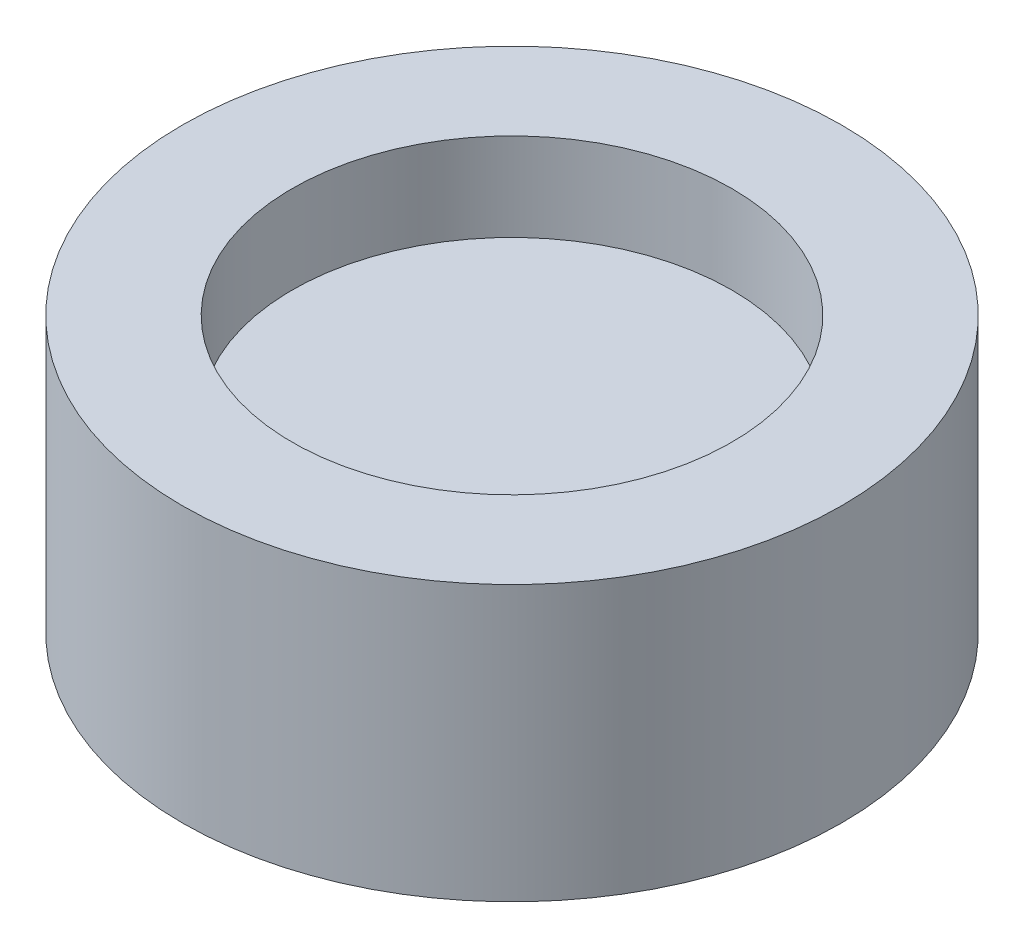
ISO-10303-21;
HEADER;
FILE_DESCRIPTION(('STEP AP214'),'2;1');
FILE_NAME('part.step','',(''),(''),'','','');
FILE_SCHEMA(('AUTOMOTIVE_DESIGN { 1 0 10303 214 1 1 1 1 }'));
ENDSEC;
DATA;
#1=APPLICATION_CONTEXT('core data for automotive mechanical design processes');
#2=APPLICATION_PROTOCOL_DEFINITION('international standard','automotive_design',2000,#1);
#3=PRODUCT_CONTEXT('',#1,'mechanical');
#4=PRODUCT('Part','Part','',(#3));
#5=PRODUCT_RELATED_PRODUCT_CATEGORY('part','',(#4));
#6=PRODUCT_DEFINITION_FORMATION('','',#4);
#7=PRODUCT_DEFINITION_CONTEXT('part definition',#1,'design');
#8=PRODUCT_DEFINITION('design','',#6,#7);
#9=PRODUCT_DEFINITION_SHAPE('','',#8);
#10=(LENGTH_UNIT() NAMED_UNIT(*) SI_UNIT(.MILLI.,.METRE.));
#11=(NAMED_UNIT(*) PLANE_ANGLE_UNIT() SI_UNIT($,.RADIAN.));
#12=(NAMED_UNIT(*) SI_UNIT($,.STERADIAN.) SOLID_ANGLE_UNIT());
#13=UNCERTAINTY_MEASURE_WITH_UNIT(LENGTH_MEASURE(1.E-05),#10,'distance_accuracy_value','');
#14=(GEOMETRIC_REPRESENTATION_CONTEXT(3) GLOBAL_UNCERTAINTY_ASSIGNED_CONTEXT((#13)) GLOBAL_UNIT_ASSIGNED_CONTEXT((#10,
#11,#12)) REPRESENTATION_CONTEXT('',''));
#15=CARTESIAN_POINT('',(0.,0.,0.));
#16=DIRECTION('',(0.,0.,1.));
#17=DIRECTION('',(1.,0.,0.));
#18=AXIS2_PLACEMENT_3D('',#15,#16,#17);
#19=CARTESIAN_POINT('',(200.,170.,0.));
#20=DIRECTION('',(0.,1.,0.));
#21=DIRECTION('',(0.,0.,1.));
#22=AXIS2_PLACEMENT_3D('',#19,#20,#21);
#23=PLANE('',#22);
#24=CARTESIAN_POINT('',(0.,170.,0.));
#25=DIRECTION('',(0.,-1.,0.));
#26=DIRECTION('',(0.,0.,-1.));
#27=AXIS2_PLACEMENT_3D('',#24,#25,#26);
#28=CIRCLE('',#27,200.);
#29=CARTESIAN_POINT('',(0.,170.,-200.));
#30=VERTEX_POINT('',#29);
#31=EDGE_CURVE('E10',#30,#30,#28,.T.);
#32=ORIENTED_EDGE('',*,*,#31,.F.);
#33=EDGE_LOOP('',(#32));
#34=FACE_BOUND('',#33,.T.);
#35=ADVANCED_FACE('F33',(#34),#23,.T.);
#36=CARTESIAN_POINT('',(0.,0.,0.));
#37=DIRECTION('',(0.,-1.,0.));
#38=DIRECTION('',(0.,0.,-1.));
#39=AXIS2_PLACEMENT_3D('',#36,#37,#38);
#40=CYLINDRICAL_SURFACE('',#39,200.);
#41=ORIENTED_EDGE('',*,*,#31,.T.);
#42=EDGE_LOOP('',(#41));
#43=FACE_BOUND('',#42,.T.);
#44=CARTESIAN_POINT('',(0.,250.,0.));
#45=DIRECTION('',(0.,-1.,0.));
#46=DIRECTION('',(0.,0.,-1.));
#47=AXIS2_PLACEMENT_3D('',#44,#45,#46);
#48=CIRCLE('',#47,200.);
#49=CARTESIAN_POINT('',(0.,250.,-200.));
#50=VERTEX_POINT('',#49);
#51=EDGE_CURVE('E39',#50,#50,#48,.T.);
#52=ORIENTED_EDGE('',*,*,#51,.F.);
#53=EDGE_LOOP('',(#52));
#54=FACE_BOUND('',#53,.T.);
#55=ADVANCED_FACE('F107',(#43,#54),#40,.F.);
#56=CARTESIAN_POINT('',(200.,250.,0.));
#57=DIRECTION('',(0.,1.,0.));
#58=DIRECTION('',(0.,0.,1.));
#59=AXIS2_PLACEMENT_3D('',#56,#57,#58);
#60=PLANE('',#59);
#61=ORIENTED_EDGE('',*,*,#51,.T.);
#62=EDGE_LOOP('',(#61));
#63=FACE_BOUND('',#62,.T.);
#64=CARTESIAN_POINT('',(0.,250.,0.));
#65=DIRECTION('',(0.,-1.,0.));
#66=DIRECTION('',(0.,0.,-1.));
#67=AXIS2_PLACEMENT_3D('',#64,#65,#66);
#68=CIRCLE('',#67,300.);
#69=CARTESIAN_POINT('',(0.,250.,-300.));
#70=VERTEX_POINT('',#69);
#71=EDGE_CURVE('E43',#70,#70,#68,.T.);
#72=ORIENTED_EDGE('',*,*,#71,.F.);
#73=EDGE_LOOP('',(#72));
#74=FACE_BOUND('',#73,.T.);
#75=ADVANCED_FACE('F101',(#63,#74),#60,.T.);
#76=CARTESIAN_POINT('',(0.,0.,0.));
#77=DIRECTION('',(0.,-1.,0.));
#78=DIRECTION('',(0.,0.,-1.));
#79=AXIS2_PLACEMENT_3D('',#76,#77,#78);
#80=CYLINDRICAL_SURFACE('',#79,300.);
#81=ORIENTED_EDGE('',*,*,#71,.T.);
#82=EDGE_LOOP('',(#81));
#83=FACE_BOUND('',#82,.T.);
#84=CARTESIAN_POINT('',(0.,0.,0.));
#85=DIRECTION('',(0.,-1.,0.));
#86=DIRECTION('',(0.,0.,-1.));
#87=AXIS2_PLACEMENT_3D('',#84,#85,#86);
#88=CIRCLE('',#87,300.);
#89=CARTESIAN_POINT('',(0.,0.,-300.));
#90=VERTEX_POINT('',#89);
#91=EDGE_CURVE('E47',#90,#90,#88,.T.);
#92=ORIENTED_EDGE('',*,*,#91,.F.);
#93=EDGE_LOOP('',(#92));
#94=FACE_BOUND('',#93,.T.);
#95=ADVANCED_FACE('F90',(#83,#94),#80,.T.);
#96=CARTESIAN_POINT('',(300.,0.,0.));
#97=DIRECTION('',(0.,-1.,0.));
#98=DIRECTION('',(0.,0.,-1.));
#99=AXIS2_PLACEMENT_3D('',#96,#97,#98);
#100=PLANE('',#99);
#101=CARTESIAN_POINT('',(-71.,0.,-55.));
#102=DIRECTION('',(0.,-1.,0.));
#103=DIRECTION('',(0.,0.,-1.));
#104=AXIS2_PLACEMENT_3D('',#101,#102,#103);
#105=CIRCLE('',#104,8.);
#106=CARTESIAN_POINT('',(-71.,0.,-63.));
#107=VERTEX_POINT('',#106);
#108=EDGE_CURVE('E71',#107,#107,#105,.T.);
#109=ORIENTED_EDGE('',*,*,#108,.F.);
#110=EDGE_LOOP('',(#109));
#111=FACE_BOUND('',#110,.T.);
#112=CARTESIAN_POINT('',(71.,0.,-55.));
#113=DIRECTION('',(0.,-1.,0.));
#114=DIRECTION('',(0.,0.,-1.));
#115=AXIS2_PLACEMENT_3D('',#112,#113,#114);
#116=CIRCLE('',#115,8.00000000000003);
#117=CARTESIAN_POINT('',(71.,0.,-63.));
#118=VERTEX_POINT('',#117);
#119=EDGE_CURVE('E65',#118,#118,#116,.T.);
#120=ORIENTED_EDGE('',*,*,#119,.F.);
#121=EDGE_LOOP('',(#120));
#122=FACE_BOUND('',#121,.T.);
#123=CARTESIAN_POINT('',(71.,0.,55.));
#124=DIRECTION('',(0.,-1.,0.));
#125=DIRECTION('',(0.,0.,-1.));
#126=AXIS2_PLACEMENT_3D('',#123,#124,#125);
#127=CIRCLE('',#126,8.00000000000003);
#128=CARTESIAN_POINT('',(71.,0.,47.));
#129=VERTEX_POINT('',#128);
#130=EDGE_CURVE('E59',#129,#129,#127,.T.);
#131=ORIENTED_EDGE('',*,*,#130,.F.);
#132=EDGE_LOOP('',(#131));
#133=FACE_BOUND('',#132,.T.);
#134=CARTESIAN_POINT('',(-71.,0.,55.));
#135=DIRECTION('',(0.,-1.,0.));
#136=DIRECTION('',(0.,0.,-1.));
#137=AXIS2_PLACEMENT_3D('',#134,#135,#136);
#138=CIRCLE('',#137,8.);
#139=CARTESIAN_POINT('',(-71.,0.,47.));
#140=VERTEX_POINT('',#139);
#141=EDGE_CURVE('E53',#140,#140,#138,.T.);
#142=ORIENTED_EDGE('',*,*,#141,.F.);
#143=EDGE_LOOP('',(#142));
#144=FACE_BOUND('',#143,.T.);
#145=ORIENTED_EDGE('',*,*,#91,.T.);
#146=EDGE_LOOP('',(#145));
#147=FACE_BOUND('',#146,.T.);
#148=ADVANCED_FACE('F86',(#111,#122,#133,#144,#147),#100,.T.);
#149=CARTESIAN_POINT('',(-71.,10.,55.));
#150=DIRECTION('',(0.,-1.,0.));
#151=DIRECTION('',(0.,0.,-1.));
#152=AXIS2_PLACEMENT_3D('',#149,#150,#151);
#153=CYLINDRICAL_SURFACE('',#152,8.);
#154=CARTESIAN_POINT('',(-71.,10.,55.));
#155=DIRECTION('',(0.,-1.,0.));
#156=DIRECTION('',(0.,0.,-1.));
#157=AXIS2_PLACEMENT_3D('',#154,#155,#156);
#158=CIRCLE('',#157,8.);
#159=CARTESIAN_POINT('',(-71.,10.,47.));
#160=VERTEX_POINT('',#159);
#161=EDGE_CURVE('E52',#160,#160,#158,.T.);
#162=ORIENTED_EDGE('',*,*,#161,.F.);
#163=EDGE_LOOP('',(#162));
#164=FACE_BOUND('',#163,.T.);
#165=ORIENTED_EDGE('',*,*,#141,.T.);
#166=EDGE_LOOP('',(#165));
#167=FACE_BOUND('',#166,.T.);
#168=ADVANCED_FACE('F89',(#164,#167),#153,.F.);
#169=CARTESIAN_POINT('',(-71.,10.,55.));
#170=DIRECTION('',(0.,-1.,0.));
#171=DIRECTION('',(0.,0.,-1.));
#172=AXIS2_PLACEMENT_3D('',#169,#170,#171);
#173=PLANE('',#172);
#174=ORIENTED_EDGE('',*,*,#161,.T.);
#175=EDGE_LOOP('',(#174));
#176=FACE_BOUND('',#175,.T.);
#177=ADVANCED_FACE('F140',(#176),#173,.T.);
#178=CARTESIAN_POINT('',(71.,10.,55.));
#179=DIRECTION('',(0.,-1.,0.));
#180=DIRECTION('',(0.,0.,-1.));
#181=AXIS2_PLACEMENT_3D('',#178,#179,#180);
#182=CYLINDRICAL_SURFACE('',#181,8.00000000000003);
#183=CARTESIAN_POINT('',(71.,10.,55.));
#184=DIRECTION('',(0.,-1.,0.));
#185=DIRECTION('',(0.,0.,-1.));
#186=AXIS2_PLACEMENT_3D('',#183,#184,#185);
#187=CIRCLE('',#186,8.00000000000003);
#188=CARTESIAN_POINT('',(71.,10.,47.));
#189=VERTEX_POINT('',#188);
#190=EDGE_CURVE('E56',#189,#189,#187,.T.);
#191=ORIENTED_EDGE('',*,*,#190,.F.);
#192=EDGE_LOOP('',(#191));
#193=FACE_BOUND('',#192,.T.);
#194=ORIENTED_EDGE('',*,*,#130,.T.);
#195=EDGE_LOOP('',(#194));
#196=FACE_BOUND('',#195,.T.);
#197=ADVANCED_FACE('F150',(#193,#196),#182,.F.);
#198=CARTESIAN_POINT('',(71.,10.,55.));
#199=DIRECTION('',(0.,-1.,0.));
#200=DIRECTION('',(0.,0.,-1.));
#201=AXIS2_PLACEMENT_3D('',#198,#199,#200);
#202=PLANE('',#201);
#203=ORIENTED_EDGE('',*,*,#190,.T.);
#204=EDGE_LOOP('',(#203));
#205=FACE_BOUND('',#204,.T.);
#206=ADVANCED_FACE('F160',(#205),#202,.T.);
#207=CARTESIAN_POINT('',(71.,10.,-55.));
#208=DIRECTION('',(0.,-1.,0.));
#209=DIRECTION('',(0.,0.,-1.));
#210=AXIS2_PLACEMENT_3D('',#207,#208,#209);
#211=CYLINDRICAL_SURFACE('',#210,8.00000000000003);
#212=CARTESIAN_POINT('',(71.,10.,-55.));
#213=DIRECTION('',(0.,-1.,0.));
#214=DIRECTION('',(0.,0.,-1.));
#215=AXIS2_PLACEMENT_3D('',#212,#213,#214);
#216=CIRCLE('',#215,8.00000000000003);
#217=CARTESIAN_POINT('',(71.,10.,-63.));
#218=VERTEX_POINT('',#217);
#219=EDGE_CURVE('E62',#218,#218,#216,.T.);
#220=ORIENTED_EDGE('',*,*,#219,.F.);
#221=EDGE_LOOP('',(#220));
#222=FACE_BOUND('',#221,.T.);
#223=ORIENTED_EDGE('',*,*,#119,.T.);
#224=EDGE_LOOP('',(#223));
#225=FACE_BOUND('',#224,.T.);
#226=ADVANCED_FACE('F170',(#222,#225),#211,.F.);
#227=CARTESIAN_POINT('',(71.,10.,-55.));
#228=DIRECTION('',(0.,-1.,0.));
#229=DIRECTION('',(0.,0.,-1.));
#230=AXIS2_PLACEMENT_3D('',#227,#228,#229);
#231=PLANE('',#230);
#232=ORIENTED_EDGE('',*,*,#219,.T.);
#233=EDGE_LOOP('',(#232));
#234=FACE_BOUND('',#233,.T.);
#235=ADVANCED_FACE('F82',(#234),#231,.T.);
#236=CARTESIAN_POINT('',(-71.,10.,-55.));
#237=DIRECTION('',(0.,-1.,0.));
#238=DIRECTION('',(0.,0.,-1.));
#239=AXIS2_PLACEMENT_3D('',#236,#237,#238);
#240=CYLINDRICAL_SURFACE('',#239,8.);
#241=CARTESIAN_POINT('',(-71.,10.,-55.));
#242=DIRECTION('',(0.,-1.,0.));
#243=DIRECTION('',(0.,0.,-1.));
#244=AXIS2_PLACEMENT_3D('',#241,#242,#243);
#245=CIRCLE('',#244,8.);
#246=CARTESIAN_POINT('',(-71.,10.,-63.));
#247=VERTEX_POINT('',#246);
#248=EDGE_CURVE('E68',#247,#247,#245,.T.);
#249=ORIENTED_EDGE('',*,*,#248,.F.);
#250=EDGE_LOOP('',(#249));
#251=FACE_BOUND('',#250,.T.);
#252=ORIENTED_EDGE('',*,*,#108,.T.);
#253=EDGE_LOOP('',(#252));
#254=FACE_BOUND('',#253,.T.);
#255=ADVANCED_FACE('F79',(#251,#254),#240,.F.);
#256=CARTESIAN_POINT('',(-71.,10.,-55.));
#257=DIRECTION('',(0.,-1.,0.));
#258=DIRECTION('',(0.,0.,-1.));
#259=AXIS2_PLACEMENT_3D('',#256,#257,#258);
#260=PLANE('',#259);
#261=ORIENTED_EDGE('',*,*,#248,.T.);
#262=EDGE_LOOP('',(#261));
#263=FACE_BOUND('',#262,.T.);
#264=ADVANCED_FACE('F77',(#263),#260,.T.);
#265=CLOSED_SHELL('',(#35,#55,#75,#95,#148,#168,#177,#197,#206,#226,#235,#255,#264));
#266=MANIFOLD_SOLID_BREP('B2',#265);
#267=ADVANCED_BREP_SHAPE_REPRESENTATION('',(#18,#266),#14);
#268=SHAPE_DEFINITION_REPRESENTATION(#9,#267);
ENDSEC;
END-ISO-10303-21;
